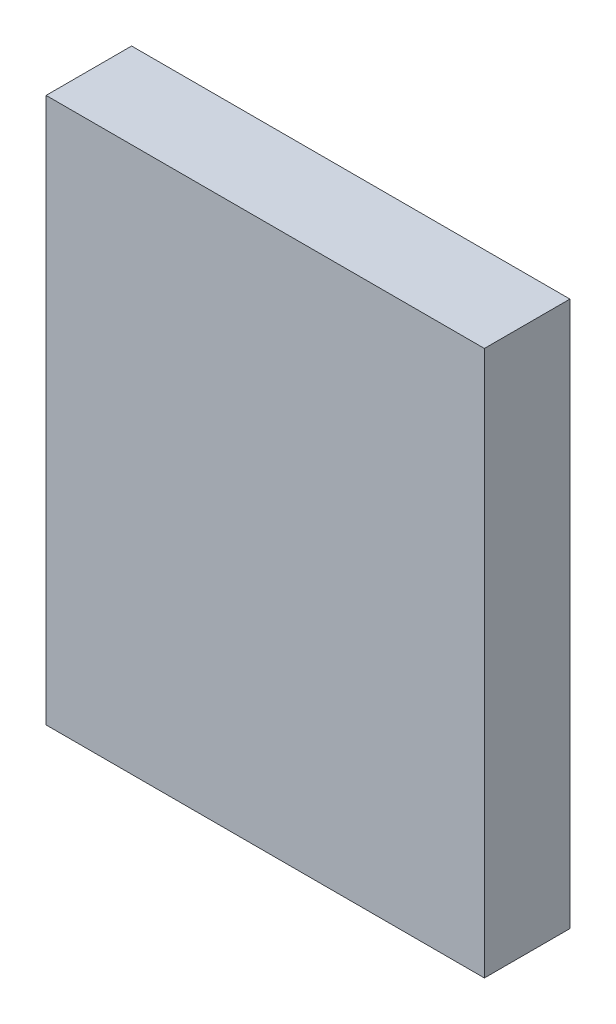
ISO-10303-21;
HEADER;
FILE_DESCRIPTION(('STEP AP214'),'2;1');
FILE_NAME('part.step','',(''),(''),'','','');
FILE_SCHEMA(('AUTOMOTIVE_DESIGN { 1 0 10303 214 1 1 1 1 }'));
ENDSEC;
DATA;
#1=APPLICATION_CONTEXT('core data for automotive mechanical design processes');
#2=APPLICATION_PROTOCOL_DEFINITION('international standard','automotive_design',2000,#1);
#3=PRODUCT_CONTEXT('',#1,'mechanical');
#4=PRODUCT('Part','Part','',(#3));
#5=PRODUCT_RELATED_PRODUCT_CATEGORY('part','',(#4));
#6=PRODUCT_DEFINITION_FORMATION('','',#4);
#7=PRODUCT_DEFINITION_CONTEXT('part definition',#1,'design');
#8=PRODUCT_DEFINITION('design','',#6,#7);
#9=PRODUCT_DEFINITION_SHAPE('','',#8);
#10=(LENGTH_UNIT() NAMED_UNIT(*) SI_UNIT(.MILLI.,.METRE.));
#11=(NAMED_UNIT(*) PLANE_ANGLE_UNIT() SI_UNIT($,.RADIAN.));
#12=(NAMED_UNIT(*) SI_UNIT($,.STERADIAN.) SOLID_ANGLE_UNIT());
#13=UNCERTAINTY_MEASURE_WITH_UNIT(LENGTH_MEASURE(1.E-05),#10,'distance_accuracy_value','');
#14=(GEOMETRIC_REPRESENTATION_CONTEXT(3) GLOBAL_UNCERTAINTY_ASSIGNED_CONTEXT((#13)) GLOBAL_UNIT_ASSIGNED_CONTEXT((#10,
#11,#12)) REPRESENTATION_CONTEXT('',''));
#15=CARTESIAN_POINT('',(0.,0.,0.));
#16=DIRECTION('',(0.,0.,1.));
#17=DIRECTION('',(1.,0.,0.));
#18=AXIS2_PLACEMENT_3D('',#15,#16,#17);
#19=CARTESIAN_POINT('',(-2.05000098,2.54999998,0.80000094));
#20=DIRECTION('',(0.,0.,-1.));
#21=DIRECTION('',(-1.,0.,0.));
#22=AXIS2_PLACEMENT_3D('',#19,#20,#21);
#23=PLANE('',#22);
#24=DIRECTION('',(1.,0.,0.));
#25=VECTOR('',#24,1.);
#26=CARTESIAN_POINT('',(-2.05000098,-2.54999998,0.80000094));
#27=LINE('',#26,#25);
#28=CARTESIAN_POINT('',(-2.05000098,-2.54999998,0.80000094));
#29=VERTEX_POINT('',#28);
#30=CARTESIAN_POINT('',(2.05000098,-2.54999998,0.80000094));
#31=VERTEX_POINT('',#30);
#32=EDGE_CURVE('E55',#29,#31,#27,.T.);
#33=ORIENTED_EDGE('',*,*,#32,.T.);
#34=DIRECTION('',(0.,1.,0.));
#35=VECTOR('',#34,1.);
#36=CARTESIAN_POINT('',(2.05000098,-2.54999998,0.80000094));
#37=LINE('',#36,#35);
#38=CARTESIAN_POINT('',(2.05000098,2.54999998,0.80000094));
#39=VERTEX_POINT('',#38);
#40=EDGE_CURVE('E57',#31,#39,#37,.T.);
#41=ORIENTED_EDGE('',*,*,#40,.T.);
#42=DIRECTION('',(1.,0.,0.));
#43=VECTOR('',#42,1.);
#44=CARTESIAN_POINT('',(2.05000098,2.54999998,0.80000094));
#45=LINE('',#44,#43);
#46=CARTESIAN_POINT('',(-2.05000098,2.54999998,0.80000094));
#47=VERTEX_POINT('',#46);
#48=EDGE_CURVE('E20',#39,#47,#45,.F.);
#49=ORIENTED_EDGE('',*,*,#48,.T.);
#50=DIRECTION('',(0.,1.,0.));
#51=VECTOR('',#50,1.);
#52=CARTESIAN_POINT('',(-2.05000098,2.54999998,0.80000094));
#53=LINE('',#52,#51);
#54=EDGE_CURVE('E80',#47,#29,#53,.F.);
#55=ORIENTED_EDGE('',*,*,#54,.T.);
#56=EDGE_LOOP('',(#33,#41,#49,#55));
#57=FACE_BOUND('',#56,.T.);
#58=ADVANCED_FACE('F17',(#57),#23,.F.);
#59=CARTESIAN_POINT('',(2.05000098,2.54999998,0.));
#60=DIRECTION('',(0.,-1.,0.));
#61=DIRECTION('',(0.,0.,-1.));
#62=AXIS2_PLACEMENT_3D('',#59,#60,#61);
#63=PLANE('',#62);
#64=DIRECTION('',(0.,0.,-1.));
#65=VECTOR('',#64,1.);
#66=CARTESIAN_POINT('',(-2.05000098,2.54999998,0.));
#67=LINE('',#66,#65);
#68=CARTESIAN_POINT('',(-2.05000098,2.54999998,0.));
#69=VERTEX_POINT('',#68);
#70=EDGE_CURVE('E68',#69,#47,#67,.F.);
#71=ORIENTED_EDGE('',*,*,#70,.T.);
#72=ORIENTED_EDGE('',*,*,#48,.F.);
#73=DIRECTION('',(0.,0.,1.));
#74=VECTOR('',#73,1.);
#75=CARTESIAN_POINT('',(2.05000098,2.54999998,0.));
#76=LINE('',#75,#74);
#77=CARTESIAN_POINT('',(2.05000098,2.54999998,0.));
#78=VERTEX_POINT('',#77);
#79=EDGE_CURVE('E63',#39,#78,#76,.F.);
#80=ORIENTED_EDGE('',*,*,#79,.T.);
#81=DIRECTION('',(-1.,0.,0.));
#82=VECTOR('',#81,1.);
#83=CARTESIAN_POINT('',(-2.05000098,2.54999998,0.));
#84=LINE('',#83,#82);
#85=EDGE_CURVE('E83',#69,#78,#84,.F.);
#86=ORIENTED_EDGE('',*,*,#85,.F.);
#87=EDGE_LOOP('',(#71,#72,#80,#86));
#88=FACE_BOUND('',#87,.T.);
#89=ADVANCED_FACE('F65',(#88),#63,.F.);
#90=CARTESIAN_POINT('',(2.05000098,-2.54999998,0.));
#91=DIRECTION('',(-1.,0.,0.));
#92=DIRECTION('',(0.,0.,1.));
#93=AXIS2_PLACEMENT_3D('',#90,#91,#92);
#94=PLANE('',#93);
#95=ORIENTED_EDGE('',*,*,#79,.F.);
#96=ORIENTED_EDGE('',*,*,#40,.F.);
#97=DIRECTION('',(0.,0.,1.));
#98=VECTOR('',#97,1.);
#99=CARTESIAN_POINT('',(2.05000098,-2.54999998,0.));
#100=LINE('',#99,#98);
#101=CARTESIAN_POINT('',(2.05000098,-2.54999998,0.));
#102=VERTEX_POINT('',#101);
#103=EDGE_CURVE('E75',#31,#102,#100,.F.);
#104=ORIENTED_EDGE('',*,*,#103,.T.);
#105=DIRECTION('',(0.,1.,0.));
#106=VECTOR('',#105,1.);
#107=CARTESIAN_POINT('',(2.05000098,2.54999998,0.));
#108=LINE('',#107,#106);
#109=EDGE_CURVE('E72',#78,#102,#108,.F.);
#110=ORIENTED_EDGE('',*,*,#109,.F.);
#111=EDGE_LOOP('',(#95,#96,#104,#110));
#112=FACE_BOUND('',#111,.T.);
#113=ADVANCED_FACE('F70',(#112),#94,.F.);
#114=CARTESIAN_POINT('',(-2.05000098,-2.54999998,0.));
#115=DIRECTION('',(0.,1.,0.));
#116=DIRECTION('',(0.,0.,1.));
#117=AXIS2_PLACEMENT_3D('',#114,#115,#116);
#118=PLANE('',#117);
#119=ORIENTED_EDGE('',*,*,#103,.F.);
#120=ORIENTED_EDGE('',*,*,#32,.F.);
#121=DIRECTION('',(0.,0.,-1.));
#122=VECTOR('',#121,1.);
#123=CARTESIAN_POINT('',(-2.05000098,-2.54999998,0.));
#124=LINE('',#123,#122);
#125=CARTESIAN_POINT('',(-2.05000098,-2.54999998,0.));
#126=VERTEX_POINT('',#125);
#127=EDGE_CURVE('E35',#29,#126,#124,.T.);
#128=ORIENTED_EDGE('',*,*,#127,.T.);
#129=DIRECTION('',(-1.,0.,0.));
#130=VECTOR('',#129,1.);
#131=CARTESIAN_POINT('',(-2.05000098,-2.54999998,0.));
#132=LINE('',#131,#130);
#133=EDGE_CURVE('E26',#102,#126,#132,.T.);
#134=ORIENTED_EDGE('',*,*,#133,.F.);
#135=EDGE_LOOP('',(#119,#120,#128,#134));
#136=FACE_BOUND('',#135,.T.);
#137=ADVANCED_FACE('F89',(#136),#118,.F.);
#138=CARTESIAN_POINT('',(-2.05000098,2.54999998,0.));
#139=DIRECTION('',(1.,0.,0.));
#140=DIRECTION('',(0.,0.,-1.));
#141=AXIS2_PLACEMENT_3D('',#138,#139,#140);
#142=PLANE('',#141);
#143=ORIENTED_EDGE('',*,*,#127,.F.);
#144=ORIENTED_EDGE('',*,*,#54,.F.);
#145=ORIENTED_EDGE('',*,*,#70,.F.);
#146=DIRECTION('',(0.,1.,0.));
#147=VECTOR('',#146,1.);
#148=CARTESIAN_POINT('',(-2.05000098,2.54999998,0.));
#149=LINE('',#148,#147);
#150=EDGE_CURVE('E11',#126,#69,#149,.T.);
#151=ORIENTED_EDGE('',*,*,#150,.F.);
#152=EDGE_LOOP('',(#143,#144,#145,#151));
#153=FACE_BOUND('',#152,.T.);
#154=ADVANCED_FACE('F91',(#153),#142,.F.);
#155=CARTESIAN_POINT('',(-2.05000098,2.54999998,0.));
#156=DIRECTION('',(0.,0.,-1.));
#157=DIRECTION('',(-1.,0.,0.));
#158=AXIS2_PLACEMENT_3D('',#155,#156,#157);
#159=PLANE('',#158);
#160=ORIENTED_EDGE('',*,*,#133,.T.);
#161=ORIENTED_EDGE('',*,*,#150,.T.);
#162=ORIENTED_EDGE('',*,*,#85,.T.);
#163=ORIENTED_EDGE('',*,*,#109,.T.);
#164=EDGE_LOOP('',(#160,#161,#162,#163));
#165=FACE_BOUND('',#164,.T.);
#166=ADVANCED_FACE('F88',(#165),#159,.T.);
#167=CLOSED_SHELL('',(#58,#89,#113,#137,#154,#166));
#168=MANIFOLD_SOLID_BREP('B1',#167);
#169=ADVANCED_BREP_SHAPE_REPRESENTATION('',(#18,#168),#14);
#170=SHAPE_DEFINITION_REPRESENTATION(#9,#169);
ENDSEC;
END-ISO-10303-21;
